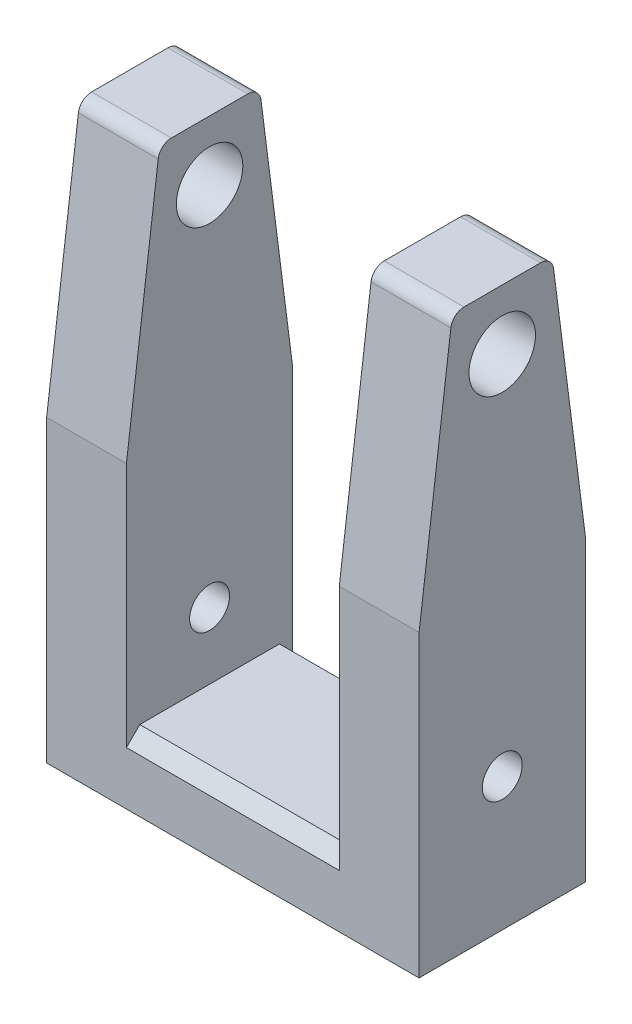
ISO-10303-21;
HEADER;
FILE_DESCRIPTION(('STEP AP214'),'2;1');
FILE_NAME('part.step','',(''),(''),'','','');
FILE_SCHEMA(('AUTOMOTIVE_DESIGN { 1 0 10303 214 1 1 1 1 }'));
ENDSEC;
DATA;
#1=APPLICATION_CONTEXT('core data for automotive mechanical design processes');
#2=APPLICATION_PROTOCOL_DEFINITION('international standard','automotive_design',2000,#1);
#3=PRODUCT_CONTEXT('',#1,'mechanical');
#4=PRODUCT('Part','Part','',(#3));
#5=PRODUCT_RELATED_PRODUCT_CATEGORY('part','',(#4));
#6=PRODUCT_DEFINITION_FORMATION('','',#4);
#7=PRODUCT_DEFINITION_CONTEXT('part definition',#1,'design');
#8=PRODUCT_DEFINITION('design','',#6,#7);
#9=PRODUCT_DEFINITION_SHAPE('','',#8);
#10=(LENGTH_UNIT() NAMED_UNIT(*) SI_UNIT(.MILLI.,.METRE.));
#11=(NAMED_UNIT(*) PLANE_ANGLE_UNIT() SI_UNIT($,.RADIAN.));
#12=(NAMED_UNIT(*) SI_UNIT($,.STERADIAN.) SOLID_ANGLE_UNIT());
#13=UNCERTAINTY_MEASURE_WITH_UNIT(LENGTH_MEASURE(1.E-05),#10,'distance_accuracy_value','');
#14=(GEOMETRIC_REPRESENTATION_CONTEXT(3) GLOBAL_UNCERTAINTY_ASSIGNED_CONTEXT((#13)) GLOBAL_UNIT_ASSIGNED_CONTEXT((#10,
#11,#12)) REPRESENTATION_CONTEXT('',''));
#15=CARTESIAN_POINT('',(0.,0.,0.));
#16=DIRECTION('',(0.,0.,1.));
#17=DIRECTION('',(1.,0.,0.));
#18=AXIS2_PLACEMENT_3D('',#15,#16,#17);
#19=CARTESIAN_POINT('',(12.,82.,-5.74004069217051));
#20=DIRECTION('',(-1.,0.,0.));
#21=DIRECTION('',(0.,0.,1.));
#22=AXIS2_PLACEMENT_3D('',#19,#20,#21);
#23=PLANE('',#22);
#24=CARTESIAN_POINT('',(12.,82.,-5.74004069217051));
#25=DIRECTION('',(1.,0.,0.));
#26=DIRECTION('',(0.,0.,1.));
#27=AXIS2_PLACEMENT_3D('',#24,#25,#26);
#28=CIRCLE('',#27,2.);
#29=CARTESIAN_POINT('',(12.,82.2543286319708,-7.72380402154221));
#30=VERTEX_POINT('',#29);
#31=CARTESIAN_POINT('',(12.,84.,-5.74004069217051));
#32=VERTEX_POINT('',#31);
#33=EDGE_CURVE('E247',#30,#32,#28,.T.);
#34=ORIENTED_EDGE('',*,*,#33,.T.);
#35=DIRECTION('',(0.,0.,1.));
#36=VECTOR('',#35,1.);
#37=CARTESIAN_POINT('',(12.,84.,5.74004069217051));
#38=LINE('',#37,#36);
#39=CARTESIAN_POINT('',(12.,84.,5.74004069217051));
#40=VERTEX_POINT('',#39);
#41=EDGE_CURVE('E250',#32,#40,#38,.T.);
#42=ORIENTED_EDGE('',*,*,#41,.T.);
#43=CARTESIAN_POINT('',(12.,82.,5.74004069217051));
#44=DIRECTION('',(1.,0.,0.));
#45=DIRECTION('',(0.,0.,1.));
#46=AXIS2_PLACEMENT_3D('',#43,#44,#45);
#47=CIRCLE('',#46,1.99999999999999);
#48=CARTESIAN_POINT('',(12.,82.2543286319707,7.72380402154221));
#49=VERTEX_POINT('',#48);
#50=EDGE_CURVE('E253',#40,#49,#47,.T.);
#51=ORIENTED_EDGE('',*,*,#50,.T.);
#52=DIRECTION('',(0.,-0.991881664685851,0.127164315985365));
#53=VECTOR('',#52,1.);
#54=CARTESIAN_POINT('',(12.,45.,12.5));
#55=LINE('',#54,#53);
#56=CARTESIAN_POINT('',(12.,45.,12.5));
#57=VERTEX_POINT('',#56);
#58=EDGE_CURVE('E255',#49,#57,#55,.T.);
#59=ORIENTED_EDGE('',*,*,#58,.T.);
#60=DIRECTION('',(0.,-1.,0.));
#61=VECTOR('',#60,1.);
#62=CARTESIAN_POINT('',(12.,45.,12.5));
#63=LINE('',#62,#61);
#64=CARTESIAN_POINT('',(12.,0.,12.5));
#65=VERTEX_POINT('',#64);
#66=EDGE_CURVE('E257',#57,#65,#63,.T.);
#67=ORIENTED_EDGE('',*,*,#66,.T.);
#68=DIRECTION('',(0.,0.,-1.));
#69=VECTOR('',#68,1.);
#70=CARTESIAN_POINT('',(12.,0.,-12.5));
#71=LINE('',#70,#69);
#72=CARTESIAN_POINT('',(12.,0.,-12.5));
#73=VERTEX_POINT('',#72);
#74=EDGE_CURVE('E259',#65,#73,#71,.T.);
#75=ORIENTED_EDGE('',*,*,#74,.T.);
#76=DIRECTION('',(0.,1.,0.));
#77=VECTOR('',#76,1.);
#78=CARTESIAN_POINT('',(12.,45.,-12.5));
#79=LINE('',#78,#77);
#80=CARTESIAN_POINT('',(12.,45.,-12.5));
#81=VERTEX_POINT('',#80);
#82=EDGE_CURVE('E261',#73,#81,#79,.T.);
#83=ORIENTED_EDGE('',*,*,#82,.T.);
#84=DIRECTION('',(0.,0.991881664685851,0.127164315985365));
#85=VECTOR('',#84,1.);
#86=CARTESIAN_POINT('',(12.,82.2543286319708,-7.72380402154221));
#87=LINE('',#86,#85);
#88=EDGE_CURVE('E263',#81,#30,#87,.T.);
#89=ORIENTED_EDGE('',*,*,#88,.T.);
#90=EDGE_LOOP('',(#34,#42,#51,#59,#67,#75,#83,#89));
#91=FACE_BOUND('',#90,.T.);
#92=CARTESIAN_POINT('',(12.,20.,0.));
#93=DIRECTION('',(1.,0.,0.));
#94=DIRECTION('',(0.,0.,-1.));
#95=AXIS2_PLACEMENT_3D('',#92,#93,#94);
#96=CIRCLE('',#95,3.);
#97=CARTESIAN_POINT('',(12.,20.,-3.));
#98=VERTEX_POINT('',#97);
#99=EDGE_CURVE('E241',#98,#98,#96,.T.);
#100=ORIENTED_EDGE('',*,*,#99,.F.);
#101=EDGE_LOOP('',(#100));
#102=FACE_BOUND('',#101,.T.);
#103=CARTESIAN_POINT('',(12.,75.,0.));
#104=DIRECTION('',(1.,0.,0.));
#105=DIRECTION('',(0.,0.,-1.));
#106=AXIS2_PLACEMENT_3D('',#103,#104,#105);
#107=CIRCLE('',#106,5.);
#108=CARTESIAN_POINT('',(12.,75.,-4.99999999999998));
#109=VERTEX_POINT('',#108);
#110=EDGE_CURVE('E235',#109,#109,#107,.T.);
#111=ORIENTED_EDGE('',*,*,#110,.F.);
#112=EDGE_LOOP('',(#111));
#113=FACE_BOUND('',#112,.T.);
#114=ADVANCED_FACE('F35',(#91,#102,#113),#23,.F.);
#115=CARTESIAN_POINT('',(0.,82.,-5.74004069217051));
#116=DIRECTION('',(-1.,0.,0.));
#117=DIRECTION('',(0.,0.,1.));
#118=AXIS2_PLACEMENT_3D('',#115,#116,#117);
#119=PLANE('',#118);
#120=DIRECTION('',(0.,0.,-1.));
#121=VECTOR('',#120,1.);
#122=CARTESIAN_POINT('',(0.,10.,12.5));
#123=LINE('',#122,#121);
#124=CARTESIAN_POINT('',(0.,10.,10.5));
#125=VERTEX_POINT('',#124);
#126=CARTESIAN_POINT('',(0.,10.,-10.5));
#127=VERTEX_POINT('',#126);
#128=EDGE_CURVE('E172',#125,#127,#123,.T.);
#129=ORIENTED_EDGE('',*,*,#128,.F.);
#130=DIRECTION('',(0.,0.70710678118655,-0.707106781186545));
#131=VECTOR('',#130,1.);
#132=CARTESIAN_POINT('',(0.,10.,10.5));
#133=LINE('',#132,#131);
#134=CARTESIAN_POINT('',(0.,8.,12.5));
#135=VERTEX_POINT('',#134);
#136=EDGE_CURVE('E309',#125,#135,#133,.F.);
#137=ORIENTED_EDGE('',*,*,#136,.T.);
#138=DIRECTION('',(0.,-1.,0.));
#139=VECTOR('',#138,1.);
#140=CARTESIAN_POINT('',(0.,45.,12.5));
#141=LINE('',#140,#139);
#142=CARTESIAN_POINT('',(0.,45.,12.5));
#143=VERTEX_POINT('',#142);
#144=EDGE_CURVE('E274',#143,#135,#141,.T.);
#145=ORIENTED_EDGE('',*,*,#144,.F.);
#146=DIRECTION('',(0.,-0.991881664685851,0.127164315985365));
#147=VECTOR('',#146,1.);
#148=CARTESIAN_POINT('',(0.,45.,12.5));
#149=LINE('',#148,#147);
#150=CARTESIAN_POINT('',(0.,82.2543286319707,7.72380402154221));
#151=VERTEX_POINT('',#150);
#152=EDGE_CURVE('E272',#151,#143,#149,.T.);
#153=ORIENTED_EDGE('',*,*,#152,.F.);
#154=CARTESIAN_POINT('',(0.,82.,5.74004069217051));
#155=DIRECTION('',(1.,0.,0.));
#156=DIRECTION('',(0.,0.,1.));
#157=AXIS2_PLACEMENT_3D('',#154,#155,#156);
#158=CIRCLE('',#157,1.99999999999999);
#159=CARTESIAN_POINT('',(0.,84.,5.74004069217051));
#160=VERTEX_POINT('',#159);
#161=EDGE_CURVE('E270',#160,#151,#158,.T.);
#162=ORIENTED_EDGE('',*,*,#161,.F.);
#163=DIRECTION('',(0.,0.,1.));
#164=VECTOR('',#163,1.);
#165=CARTESIAN_POINT('',(0.,84.,5.74004069217051));
#166=LINE('',#165,#164);
#167=CARTESIAN_POINT('',(0.,84.,-5.74004069217051));
#168=VERTEX_POINT('',#167);
#169=EDGE_CURVE('E268',#168,#160,#166,.T.);
#170=ORIENTED_EDGE('',*,*,#169,.F.);
#171=CARTESIAN_POINT('',(0.,82.,-5.74004069217051));
#172=DIRECTION('',(1.,0.,0.));
#173=DIRECTION('',(0.,0.,1.));
#174=AXIS2_PLACEMENT_3D('',#171,#172,#173);
#175=CIRCLE('',#174,2.);
#176=CARTESIAN_POINT('',(0.,82.2543286319708,-7.72380402154221));
#177=VERTEX_POINT('',#176);
#178=EDGE_CURVE('E244',#177,#168,#175,.T.);
#179=ORIENTED_EDGE('',*,*,#178,.F.);
#180=DIRECTION('',(0.,0.991881664685851,0.127164315985365));
#181=VECTOR('',#180,1.);
#182=CARTESIAN_POINT('',(0.,82.2543286319708,-7.72380402154221));
#183=LINE('',#182,#181);
#184=CARTESIAN_POINT('',(0.,45.,-12.5));
#185=VERTEX_POINT('',#184);
#186=EDGE_CURVE('E251',#185,#177,#183,.T.);
#187=ORIENTED_EDGE('',*,*,#186,.F.);
#188=DIRECTION('',(0.,1.,0.));
#189=VECTOR('',#188,1.);
#190=CARTESIAN_POINT('',(0.,45.,-12.5));
#191=LINE('',#190,#189);
#192=CARTESIAN_POINT('',(0.,7.99999999999999,-12.5));
#193=VERTEX_POINT('',#192);
#194=EDGE_CURVE('E51',#193,#185,#191,.T.);
#195=ORIENTED_EDGE('',*,*,#194,.F.);
#196=DIRECTION('',(0.,-0.707106781186546,-0.707106781186549));
#197=VECTOR('',#196,1.);
#198=CARTESIAN_POINT('',(0.,7.99999999999999,-12.5));
#199=LINE('',#198,#197);
#200=EDGE_CURVE('E44',#193,#127,#199,.F.);
#201=ORIENTED_EDGE('',*,*,#200,.T.);
#202=EDGE_LOOP('',(#129,#137,#145,#153,#162,#170,#179,#187,#195,#201));
#203=FACE_BOUND('',#202,.T.);
#204=CARTESIAN_POINT('',(0.,20.,0.));
#205=DIRECTION('',(1.,0.,0.));
#206=DIRECTION('',(0.,0.,-1.));
#207=AXIS2_PLACEMENT_3D('',#204,#205,#206);
#208=CIRCLE('',#207,3.);
#209=CARTESIAN_POINT('',(0.,20.,-3.));
#210=VERTEX_POINT('',#209);
#211=EDGE_CURVE('E238',#210,#210,#208,.T.);
#212=ORIENTED_EDGE('',*,*,#211,.T.);
#213=EDGE_LOOP('',(#212));
#214=FACE_BOUND('',#213,.T.);
#215=CARTESIAN_POINT('',(0.,75.,0.));
#216=DIRECTION('',(1.,0.,0.));
#217=DIRECTION('',(0.,0.,-1.));
#218=AXIS2_PLACEMENT_3D('',#215,#216,#217);
#219=CIRCLE('',#218,5.);
#220=CARTESIAN_POINT('',(0.,75.,-4.99999999999998));
#221=VERTEX_POINT('',#220);
#222=EDGE_CURVE('E234',#221,#221,#219,.T.);
#223=ORIENTED_EDGE('',*,*,#222,.T.);
#224=EDGE_LOOP('',(#223));
#225=FACE_BOUND('',#224,.T.);
#226=ADVANCED_FACE('F314',(#203,#214,#225),#119,.T.);
#227=CARTESIAN_POINT('',(12.,82.,-5.74004069217051));
#228=DIRECTION('',(-1.,0.,0.));
#229=DIRECTION('',(0.,0.,1.));
#230=AXIS2_PLACEMENT_3D('',#227,#228,#229);
#231=CYLINDRICAL_SURFACE('',#230,2.);
#232=ORIENTED_EDGE('',*,*,#178,.T.);
#233=DIRECTION('',(-1.,0.,0.));
#234=VECTOR('',#233,1.);
#235=CARTESIAN_POINT('',(12.,84.,-5.74004069217051));
#236=LINE('',#235,#234);
#237=EDGE_CURVE('E296',#32,#168,#236,.T.);
#238=ORIENTED_EDGE('',*,*,#237,.F.);
#239=ORIENTED_EDGE('',*,*,#33,.F.);
#240=DIRECTION('',(-1.,0.,0.));
#241=VECTOR('',#240,1.);
#242=CARTESIAN_POINT('',(12.,82.2543286319708,-7.72380402154221));
#243=LINE('',#242,#241);
#244=EDGE_CURVE('E265',#30,#177,#243,.T.);
#245=ORIENTED_EDGE('',*,*,#244,.T.);
#246=EDGE_LOOP('',(#232,#238,#239,#245));
#247=FACE_BOUND('',#246,.T.);
#248=ADVANCED_FACE('F368',(#247),#231,.T.);
#249=CARTESIAN_POINT('',(12.,84.,5.74004069217051));
#250=DIRECTION('',(0.,-1.,0.));
#251=DIRECTION('',(0.,0.,-1.));
#252=AXIS2_PLACEMENT_3D('',#249,#250,#251);
#253=PLANE('',#252);
#254=ORIENTED_EDGE('',*,*,#169,.T.);
#255=DIRECTION('',(-1.,0.,0.));
#256=VECTOR('',#255,1.);
#257=CARTESIAN_POINT('',(12.,84.,5.74004069217051));
#258=LINE('',#257,#256);
#259=EDGE_CURVE('E293',#40,#160,#258,.T.);
#260=ORIENTED_EDGE('',*,*,#259,.F.);
#261=ORIENTED_EDGE('',*,*,#41,.F.);
#262=ORIENTED_EDGE('',*,*,#237,.T.);
#263=EDGE_LOOP('',(#254,#260,#261,#262));
#264=FACE_BOUND('',#263,.T.);
#265=ADVANCED_FACE('F397',(#264),#253,.F.);
#266=CARTESIAN_POINT('',(12.,82.,5.74004069217051));
#267=DIRECTION('',(-1.,0.,0.));
#268=DIRECTION('',(0.,0.,1.));
#269=AXIS2_PLACEMENT_3D('',#266,#267,#268);
#270=CYLINDRICAL_SURFACE('',#269,1.99999999999999);
#271=ORIENTED_EDGE('',*,*,#161,.T.);
#272=DIRECTION('',(-1.,0.,0.));
#273=VECTOR('',#272,1.);
#274=CARTESIAN_POINT('',(12.,82.2543286319707,7.72380402154221));
#275=LINE('',#274,#273);
#276=EDGE_CURVE('E290',#49,#151,#275,.T.);
#277=ORIENTED_EDGE('',*,*,#276,.F.);
#278=ORIENTED_EDGE('',*,*,#50,.F.);
#279=ORIENTED_EDGE('',*,*,#259,.T.);
#280=EDGE_LOOP('',(#271,#277,#278,#279));
#281=FACE_BOUND('',#280,.T.);
#282=ADVANCED_FACE('F393',(#281),#270,.T.);
#283=CARTESIAN_POINT('',(12.,45.,12.5));
#284=DIRECTION('',(0.,-0.127164315985365,-0.99188166468585));
#285=DIRECTION('',(0.,0.991881664685851,-0.127164315985365));
#286=AXIS2_PLACEMENT_3D('',#283,#284,#285);
#287=PLANE('',#286);
#288=ORIENTED_EDGE('',*,*,#152,.T.);
#289=DIRECTION('',(-1.,0.,0.));
#290=VECTOR('',#289,1.);
#291=CARTESIAN_POINT('',(12.,45.,12.5));
#292=LINE('',#291,#290);
#293=EDGE_CURVE('E287',#57,#143,#292,.T.);
#294=ORIENTED_EDGE('',*,*,#293,.F.);
#295=ORIENTED_EDGE('',*,*,#58,.F.);
#296=ORIENTED_EDGE('',*,*,#276,.T.);
#297=EDGE_LOOP('',(#288,#294,#295,#296));
#298=FACE_BOUND('',#297,.T.);
#299=ADVANCED_FACE('F389',(#298),#287,.F.);
#300=CARTESIAN_POINT('',(12.,45.,12.5));
#301=DIRECTION('',(0.,0.,-1.));
#302=DIRECTION('',(-1.,0.,0.));
#303=AXIS2_PLACEMENT_3D('',#300,#301,#302);
#304=PLANE('',#303);
#305=ORIENTED_EDGE('',*,*,#144,.T.);
#306=DIRECTION('',(-1.,0.,0.));
#307=VECTOR('',#306,1.);
#308=CARTESIAN_POINT('',(12.,8.,12.5));
#309=LINE('',#308,#307);
#310=CARTESIAN_POINT('',(-32.,8.00000000000001,12.5));
#311=VERTEX_POINT('',#310);
#312=EDGE_CURVE('E304',#135,#311,#309,.T.);
#313=ORIENTED_EDGE('',*,*,#312,.T.);
#314=DIRECTION('',(0.,-1.,0.));
#315=VECTOR('',#314,1.);
#316=CARTESIAN_POINT('',(-32.,45.,12.5));
#317=LINE('',#316,#315);
#318=CARTESIAN_POINT('',(-32.,45.,12.5));
#319=VERTEX_POINT('',#318);
#320=EDGE_CURVE('E221',#319,#311,#317,.T.);
#321=ORIENTED_EDGE('',*,*,#320,.F.);
#322=DIRECTION('',(1.,0.,0.));
#323=VECTOR('',#322,1.);
#324=CARTESIAN_POINT('',(-44.,45.,12.5));
#325=LINE('',#324,#323);
#326=CARTESIAN_POINT('',(-44.,45.,12.5));
#327=VERTEX_POINT('',#326);
#328=EDGE_CURVE('E227',#327,#319,#325,.T.);
#329=ORIENTED_EDGE('',*,*,#328,.F.);
#330=DIRECTION('',(0.,-1.,0.));
#331=VECTOR('',#330,1.);
#332=CARTESIAN_POINT('',(-44.,45.,12.5));
#333=LINE('',#332,#331);
#334=CARTESIAN_POINT('',(-44.,0.,12.5));
#335=VERTEX_POINT('',#334);
#336=EDGE_CURVE('E200',#327,#335,#333,.T.);
#337=ORIENTED_EDGE('',*,*,#336,.T.);
#338=DIRECTION('',(-1.,0.,0.));
#339=VECTOR('',#338,1.);
#340=CARTESIAN_POINT('',(12.,0.,12.5));
#341=LINE('',#340,#339);
#342=EDGE_CURVE('E285',#65,#335,#341,.T.);
#343=ORIENTED_EDGE('',*,*,#342,.F.);
#344=ORIENTED_EDGE('',*,*,#66,.F.);
#345=ORIENTED_EDGE('',*,*,#293,.T.);
#346=EDGE_LOOP('',(#305,#313,#321,#329,#337,#343,#344,#345));
#347=FACE_BOUND('',#346,.T.);
#348=ADVANCED_FACE('F385',(#347),#304,.F.);
#349=CARTESIAN_POINT('',(12.,0.,-12.5));
#350=DIRECTION('',(0.,1.,0.));
#351=DIRECTION('',(0.,0.,1.));
#352=AXIS2_PLACEMENT_3D('',#349,#350,#351);
#353=PLANE('',#352);
#354=ORIENTED_EDGE('',*,*,#342,.T.);
#355=DIRECTION('',(0.,0.,-1.));
#356=VECTOR('',#355,1.);
#357=CARTESIAN_POINT('',(-44.,0.,-12.5));
#358=LINE('',#357,#356);
#359=CARTESIAN_POINT('',(-44.,0.,-12.5));
#360=VERTEX_POINT('',#359);
#361=EDGE_CURVE('E203',#335,#360,#358,.T.);
#362=ORIENTED_EDGE('',*,*,#361,.T.);
#363=DIRECTION('',(-1.,0.,0.));
#364=VECTOR('',#363,1.);
#365=CARTESIAN_POINT('',(12.,0.,-12.5));
#366=LINE('',#365,#364);
#367=EDGE_CURVE('E283',#73,#360,#366,.T.);
#368=ORIENTED_EDGE('',*,*,#367,.F.);
#369=ORIENTED_EDGE('',*,*,#74,.F.);
#370=EDGE_LOOP('',(#354,#362,#368,#369));
#371=FACE_BOUND('',#370,.T.);
#372=ADVANCED_FACE('F382',(#371),#353,.F.);
#373=CARTESIAN_POINT('',(12.,45.,-12.5));
#374=DIRECTION('',(0.,0.,1.));
#375=DIRECTION('',(1.,0.,0.));
#376=AXIS2_PLACEMENT_3D('',#373,#374,#375);
#377=PLANE('',#376);
#378=DIRECTION('',(1.,0.,0.));
#379=VECTOR('',#378,1.);
#380=CARTESIAN_POINT('',(12.,7.99999999999999,-12.5));
#381=LINE('',#380,#379);
#382=CARTESIAN_POINT('',(-32.,8.00000000000001,-12.5));
#383=VERTEX_POINT('',#382);
#384=EDGE_CURVE('E307',#383,#193,#381,.T.);
#385=ORIENTED_EDGE('',*,*,#384,.T.);
#386=ORIENTED_EDGE('',*,*,#194,.T.);
#387=DIRECTION('',(-1.,0.,0.));
#388=VECTOR('',#387,1.);
#389=CARTESIAN_POINT('',(12.,45.,-12.5));
#390=LINE('',#389,#388);
#391=EDGE_CURVE('E280',#81,#185,#390,.T.);
#392=ORIENTED_EDGE('',*,*,#391,.F.);
#393=ORIENTED_EDGE('',*,*,#82,.F.);
#394=ORIENTED_EDGE('',*,*,#367,.T.);
#395=DIRECTION('',(0.,1.,0.));
#396=VECTOR('',#395,1.);
#397=CARTESIAN_POINT('',(-44.,45.,-12.5));
#398=LINE('',#397,#396);
#399=CARTESIAN_POINT('',(-44.,45.,-12.5));
#400=VERTEX_POINT('',#399);
#401=EDGE_CURVE('E206',#360,#400,#398,.T.);
#402=ORIENTED_EDGE('',*,*,#401,.T.);
#403=DIRECTION('',(1.,0.,0.));
#404=VECTOR('',#403,1.);
#405=CARTESIAN_POINT('',(-44.,45.,-12.5));
#406=LINE('',#405,#404);
#407=CARTESIAN_POINT('',(-32.,45.,-12.5));
#408=VERTEX_POINT('',#407);
#409=EDGE_CURVE('E225',#400,#408,#406,.T.);
#410=ORIENTED_EDGE('',*,*,#409,.T.);
#411=DIRECTION('',(0.,1.,0.));
#412=VECTOR('',#411,1.);
#413=CARTESIAN_POINT('',(-32.,45.,-12.5));
#414=LINE('',#413,#412);
#415=EDGE_CURVE('E59',#383,#408,#414,.T.);
#416=ORIENTED_EDGE('',*,*,#415,.F.);
#417=EDGE_LOOP('',(#385,#386,#392,#393,#394,#402,#410,#416));
#418=FACE_BOUND('',#417,.T.);
#419=ADVANCED_FACE('F378',(#418),#377,.F.);
#420=CARTESIAN_POINT('',(12.,82.2543286319708,-7.72380402154221));
#421=DIRECTION('',(0.,-0.127164315985365,0.99188166468585));
#422=DIRECTION('',(0.,-0.991881664685851,-0.127164315985365));
#423=AXIS2_PLACEMENT_3D('',#420,#421,#422);
#424=PLANE('',#423);
#425=ORIENTED_EDGE('',*,*,#186,.T.);
#426=ORIENTED_EDGE('',*,*,#244,.F.);
#427=ORIENTED_EDGE('',*,*,#88,.F.);
#428=ORIENTED_EDGE('',*,*,#391,.T.);
#429=EDGE_LOOP('',(#425,#426,#427,#428));
#430=FACE_BOUND('',#429,.T.);
#431=ADVANCED_FACE('F375',(#430),#424,.F.);
#432=CARTESIAN_POINT('',(12.,20.,0.));
#433=DIRECTION('',(-1.,0.,0.));
#434=DIRECTION('',(0.,0.,1.));
#435=AXIS2_PLACEMENT_3D('',#432,#433,#434);
#436=CYLINDRICAL_SURFACE('',#435,3.);
#437=ORIENTED_EDGE('',*,*,#99,.T.);
#438=EDGE_LOOP('',(#437));
#439=FACE_BOUND('',#438,.T.);
#440=ORIENTED_EDGE('',*,*,#211,.F.);
#441=EDGE_LOOP('',(#440));
#442=FACE_BOUND('',#441,.T.);
#443=ADVANCED_FACE('F372',(#439,#442),#436,.F.);
#444=CARTESIAN_POINT('',(12.,75.,0.));
#445=DIRECTION('',(-1.,0.,0.));
#446=DIRECTION('',(0.,0.,1.));
#447=AXIS2_PLACEMENT_3D('',#444,#445,#446);
#448=CYLINDRICAL_SURFACE('',#447,5.);
#449=ORIENTED_EDGE('',*,*,#110,.T.);
#450=EDGE_LOOP('',(#449));
#451=FACE_BOUND('',#450,.T.);
#452=ORIENTED_EDGE('',*,*,#222,.F.);
#453=EDGE_LOOP('',(#452));
#454=FACE_BOUND('',#453,.T.);
#455=ADVANCED_FACE('F457',(#451,#454),#448,.F.);
#456=CARTESIAN_POINT('',(-16.,10.,12.5));
#457=DIRECTION('',(0.,-1.,0.));
#458=DIRECTION('',(0.,0.,-1.));
#459=AXIS2_PLACEMENT_3D('',#456,#457,#458);
#460=PLANE('',#459);
#461=DIRECTION('',(0.,0.,-1.));
#462=VECTOR('',#461,1.);
#463=CARTESIAN_POINT('',(-32.,10.,12.5));
#464=LINE('',#463,#462);
#465=CARTESIAN_POINT('',(-32.,10.,10.5));
#466=VERTEX_POINT('',#465);
#467=CARTESIAN_POINT('',(-32.,10.,-10.5));
#468=VERTEX_POINT('',#467);
#469=EDGE_CURVE('E328',#466,#468,#464,.T.);
#470=ORIENTED_EDGE('',*,*,#469,.F.);
#471=DIRECTION('',(1.,0.,0.));
#472=VECTOR('',#471,1.);
#473=CARTESIAN_POINT('',(-16.,10.,10.5));
#474=LINE('',#473,#472);
#475=EDGE_CURVE('E301',#466,#125,#474,.T.);
#476=ORIENTED_EDGE('',*,*,#475,.T.);
#477=ORIENTED_EDGE('',*,*,#128,.T.);
#478=DIRECTION('',(-1.,0.,0.));
#479=VECTOR('',#478,1.);
#480=CARTESIAN_POINT('',(-16.,10.,-10.5));
#481=LINE('',#480,#479);
#482=EDGE_CURVE('E299',#127,#468,#481,.T.);
#483=ORIENTED_EDGE('',*,*,#482,.T.);
#484=EDGE_LOOP('',(#470,#476,#477,#483));
#485=FACE_BOUND('',#484,.T.);
#486=ADVANCED_FACE('F321',(#485),#460,.F.);
#487=CARTESIAN_POINT('',(-44.,82.,-5.74004069217051));
#488=DIRECTION('',(1.,0.,0.));
#489=DIRECTION('',(0.,0.,1.));
#490=AXIS2_PLACEMENT_3D('',#487,#488,#489);
#491=PLANE('',#490);
#492=CARTESIAN_POINT('',(-44.,82.,-5.74004069217051));
#493=DIRECTION('',(1.,0.,0.));
#494=DIRECTION('',(0.,0.,1.));
#495=AXIS2_PLACEMENT_3D('',#492,#493,#494);
#496=CIRCLE('',#495,2.);
#497=CARTESIAN_POINT('',(-44.,82.2543286319708,-7.72380402154221));
#498=VERTEX_POINT('',#497);
#499=CARTESIAN_POINT('',(-44.,84.,-5.74004069217051));
#500=VERTEX_POINT('',#499);
#501=EDGE_CURVE('E180',#498,#500,#496,.T.);
#502=ORIENTED_EDGE('',*,*,#501,.F.);
#503=DIRECTION('',(0.,0.991881664685851,0.127164315985365));
#504=VECTOR('',#503,1.);
#505=CARTESIAN_POINT('',(-44.,82.2543286319708,-7.72380402154221));
#506=LINE('',#505,#504);
#507=EDGE_CURVE('E209',#400,#498,#506,.T.);
#508=ORIENTED_EDGE('',*,*,#507,.F.);
#509=ORIENTED_EDGE('',*,*,#401,.F.);
#510=ORIENTED_EDGE('',*,*,#361,.F.);
#511=ORIENTED_EDGE('',*,*,#336,.F.);
#512=DIRECTION('',(0.,-0.991881664685851,0.127164315985365));
#513=VECTOR('',#512,1.);
#514=CARTESIAN_POINT('',(-44.,45.,12.5));
#515=LINE('',#514,#513);
#516=CARTESIAN_POINT('',(-44.,82.2543286319707,7.72380402154221));
#517=VERTEX_POINT('',#516);
#518=EDGE_CURVE('E197',#517,#327,#515,.T.);
#519=ORIENTED_EDGE('',*,*,#518,.F.);
#520=CARTESIAN_POINT('',(-44.,82.,5.74004069217051));
#521=DIRECTION('',(1.,0.,0.));
#522=DIRECTION('',(0.,0.,1.));
#523=AXIS2_PLACEMENT_3D('',#520,#521,#522);
#524=CIRCLE('',#523,1.99999999999999);
#525=CARTESIAN_POINT('',(-44.,84.,5.74004069217051));
#526=VERTEX_POINT('',#525);
#527=EDGE_CURVE('E183',#526,#517,#524,.T.);
#528=ORIENTED_EDGE('',*,*,#527,.F.);
#529=DIRECTION('',(0.,0.,1.));
#530=VECTOR('',#529,1.);
#531=CARTESIAN_POINT('',(-44.,84.,5.74004069217051));
#532=LINE('',#531,#530);
#533=EDGE_CURVE('E164',#500,#526,#532,.T.);
#534=ORIENTED_EDGE('',*,*,#533,.F.);
#535=EDGE_LOOP('',(#502,#508,#509,#510,#511,#519,#528,#534));
#536=FACE_BOUND('',#535,.T.);
#537=CARTESIAN_POINT('',(-44.,20.,0.));
#538=DIRECTION('',(1.,0.,0.));
#539=DIRECTION('',(0.,0.,-1.));
#540=AXIS2_PLACEMENT_3D('',#537,#538,#539);
#541=CIRCLE('',#540,3.);
#542=CARTESIAN_POINT('',(-44.,20.,-3.));
#543=VERTEX_POINT('',#542);
#544=EDGE_CURVE('E213',#543,#543,#541,.T.);
#545=ORIENTED_EDGE('',*,*,#544,.T.);
#546=EDGE_LOOP('',(#545));
#547=FACE_BOUND('',#546,.T.);
#548=CARTESIAN_POINT('',(-44.,75.,0.));
#549=DIRECTION('',(1.,0.,0.));
#550=DIRECTION('',(0.,0.,-1.));
#551=AXIS2_PLACEMENT_3D('',#548,#549,#550);
#552=CIRCLE('',#551,5.);
#553=CARTESIAN_POINT('',(-44.,75.,-4.99999999999998));
#554=VERTEX_POINT('',#553);
#555=EDGE_CURVE('E333',#554,#554,#552,.T.);
#556=ORIENTED_EDGE('',*,*,#555,.T.);
#557=EDGE_LOOP('',(#556));
#558=FACE_BOUND('',#557,.T.);
#559=ADVANCED_FACE('F177',(#536,#547,#558),#491,.F.);
#560=CARTESIAN_POINT('',(-32.,82.,-5.74004069217051));
#561=DIRECTION('',(1.,0.,0.));
#562=DIRECTION('',(0.,0.,1.));
#563=AXIS2_PLACEMENT_3D('',#560,#561,#562);
#564=PLANE('',#563);
#565=ORIENTED_EDGE('',*,*,#320,.T.);
#566=DIRECTION('',(0.,-0.70710678118655,0.707106781186545));
#567=VECTOR('',#566,1.);
#568=CARTESIAN_POINT('',(-32.,10.,10.5));
#569=LINE('',#568,#567);
#570=EDGE_CURVE('E312',#311,#466,#569,.F.);
#571=ORIENTED_EDGE('',*,*,#570,.T.);
#572=ORIENTED_EDGE('',*,*,#469,.T.);
#573=DIRECTION('',(0.,0.707106781186546,0.707106781186549));
#574=VECTOR('',#573,1.);
#575=CARTESIAN_POINT('',(-32.,7.99999999999999,-12.5));
#576=LINE('',#575,#574);
#577=EDGE_CURVE('E11',#468,#383,#576,.F.);
#578=ORIENTED_EDGE('',*,*,#577,.T.);
#579=ORIENTED_EDGE('',*,*,#415,.T.);
#580=DIRECTION('',(0.,0.991881664685851,0.127164315985365));
#581=VECTOR('',#580,1.);
#582=CARTESIAN_POINT('',(-32.,82.2543286319708,-7.72380402154221));
#583=LINE('',#582,#581);
#584=CARTESIAN_POINT('',(-32.,82.2543286319708,-7.72380402154221));
#585=VERTEX_POINT('',#584);
#586=EDGE_CURVE('E188',#408,#585,#583,.T.);
#587=ORIENTED_EDGE('',*,*,#586,.T.);
#588=CARTESIAN_POINT('',(-32.,82.,-5.74004069217051));
#589=DIRECTION('',(1.,0.,0.));
#590=DIRECTION('',(0.,0.,1.));
#591=AXIS2_PLACEMENT_3D('',#588,#589,#590);
#592=CIRCLE('',#591,2.);
#593=CARTESIAN_POINT('',(-32.,84.,-5.74004069217051));
#594=VERTEX_POINT('',#593);
#595=EDGE_CURVE('E211',#585,#594,#592,.T.);
#596=ORIENTED_EDGE('',*,*,#595,.T.);
#597=DIRECTION('',(0.,0.,1.));
#598=VECTOR('',#597,1.);
#599=CARTESIAN_POINT('',(-32.,84.,5.74004069217051));
#600=LINE('',#599,#598);
#601=CARTESIAN_POINT('',(-32.,84.,5.74004069217051));
#602=VERTEX_POINT('',#601);
#603=EDGE_CURVE('E167',#594,#602,#600,.T.);
#604=ORIENTED_EDGE('',*,*,#603,.T.);
#605=CARTESIAN_POINT('',(-32.,82.,5.74004069217051));
#606=DIRECTION('',(1.,0.,0.));
#607=DIRECTION('',(0.,0.,1.));
#608=AXIS2_PLACEMENT_3D('',#605,#606,#607);
#609=CIRCLE('',#608,1.99999999999999);
#610=CARTESIAN_POINT('',(-32.,82.2543286319707,7.72380402154221));
#611=VERTEX_POINT('',#610);
#612=EDGE_CURVE('E215',#602,#611,#609,.T.);
#613=ORIENTED_EDGE('',*,*,#612,.T.);
#614=DIRECTION('',(0.,-0.991881664685851,0.127164315985365));
#615=VECTOR('',#614,1.);
#616=CARTESIAN_POINT('',(-32.,45.,12.5));
#617=LINE('',#616,#615);
#618=EDGE_CURVE('E218',#611,#319,#617,.T.);
#619=ORIENTED_EDGE('',*,*,#618,.T.);
#620=EDGE_LOOP('',(#565,#571,#572,#578,#579,#587,#596,#604,#613,#619));
#621=FACE_BOUND('',#620,.T.);
#622=CARTESIAN_POINT('',(-32.,20.,0.));
#623=DIRECTION('',(1.,0.,0.));
#624=DIRECTION('',(0.,0.,-1.));
#625=AXIS2_PLACEMENT_3D('',#622,#623,#624);
#626=CIRCLE('',#625,3.);
#627=CARTESIAN_POINT('',(-32.,20.,-3.));
#628=VERTEX_POINT('',#627);
#629=EDGE_CURVE('E193',#628,#628,#626,.T.);
#630=ORIENTED_EDGE('',*,*,#629,.F.);
#631=EDGE_LOOP('',(#630));
#632=FACE_BOUND('',#631,.T.);
#633=CARTESIAN_POINT('',(-32.,75.,0.));
#634=DIRECTION('',(1.,0.,0.));
#635=DIRECTION('',(0.,0.,-1.));
#636=AXIS2_PLACEMENT_3D('',#633,#634,#635);
#637=CIRCLE('',#636,5.);
#638=CARTESIAN_POINT('',(-32.,75.,-4.99999999999998));
#639=VERTEX_POINT('',#638);
#640=EDGE_CURVE('E330',#639,#639,#637,.T.);
#641=ORIENTED_EDGE('',*,*,#640,.F.);
#642=EDGE_LOOP('',(#641));
#643=FACE_BOUND('',#642,.T.);
#644=ADVANCED_FACE('F326',(#621,#632,#643),#564,.T.);
#645=CARTESIAN_POINT('',(-44.,82.,-5.74004069217051));
#646=DIRECTION('',(1.,0.,0.));
#647=DIRECTION('',(0.,0.,1.));
#648=AXIS2_PLACEMENT_3D('',#645,#646,#647);
#649=CYLINDRICAL_SURFACE('',#648,2.);
#650=ORIENTED_EDGE('',*,*,#595,.F.);
#651=DIRECTION('',(1.,0.,0.));
#652=VECTOR('',#651,1.);
#653=CARTESIAN_POINT('',(-44.,82.2543286319708,-7.72380402154221));
#654=LINE('',#653,#652);
#655=EDGE_CURVE('E186',#498,#585,#654,.T.);
#656=ORIENTED_EDGE('',*,*,#655,.F.);
#657=ORIENTED_EDGE('',*,*,#501,.T.);
#658=DIRECTION('',(1.,0.,0.));
#659=VECTOR('',#658,1.);
#660=CARTESIAN_POINT('',(-44.,84.,-5.74004069217051));
#661=LINE('',#660,#659);
#662=EDGE_CURVE('E161',#500,#594,#661,.T.);
#663=ORIENTED_EDGE('',*,*,#662,.T.);
#664=EDGE_LOOP('',(#650,#656,#657,#663));
#665=FACE_BOUND('',#664,.T.);
#666=ADVANCED_FACE('F185',(#665),#649,.T.);
#667=CARTESIAN_POINT('',(-44.,84.,5.74004069217051));
#668=DIRECTION('',(0.,-1.,0.));
#669=DIRECTION('',(0.,0.,-1.));
#670=AXIS2_PLACEMENT_3D('',#667,#668,#669);
#671=PLANE('',#670);
#672=ORIENTED_EDGE('',*,*,#603,.F.);
#673=ORIENTED_EDGE('',*,*,#662,.F.);
#674=ORIENTED_EDGE('',*,*,#533,.T.);
#675=DIRECTION('',(1.,0.,0.));
#676=VECTOR('',#675,1.);
#677=CARTESIAN_POINT('',(-44.,84.,5.74004069217051));
#678=LINE('',#677,#676);
#679=EDGE_CURVE('E173',#526,#602,#678,.T.);
#680=ORIENTED_EDGE('',*,*,#679,.T.);
#681=EDGE_LOOP('',(#672,#673,#674,#680));
#682=FACE_BOUND('',#681,.T.);
#683=ADVANCED_FACE('F163',(#682),#671,.F.);
#684=CARTESIAN_POINT('',(-44.,82.,5.74004069217051));
#685=DIRECTION('',(1.,0.,0.));
#686=DIRECTION('',(0.,0.,1.));
#687=AXIS2_PLACEMENT_3D('',#684,#685,#686);
#688=CYLINDRICAL_SURFACE('',#687,1.99999999999999);
#689=ORIENTED_EDGE('',*,*,#612,.F.);
#690=ORIENTED_EDGE('',*,*,#679,.F.);
#691=ORIENTED_EDGE('',*,*,#527,.T.);
#692=DIRECTION('',(1.,0.,0.));
#693=VECTOR('',#692,1.);
#694=CARTESIAN_POINT('',(-44.,82.2543286319707,7.72380402154221));
#695=LINE('',#694,#693);
#696=EDGE_CURVE('E229',#517,#611,#695,.T.);
#697=ORIENTED_EDGE('',*,*,#696,.T.);
#698=EDGE_LOOP('',(#689,#690,#691,#697));
#699=FACE_BOUND('',#698,.T.);
#700=ADVANCED_FACE('F433',(#699),#688,.T.);
#701=CARTESIAN_POINT('',(-44.,45.,12.5));
#702=DIRECTION('',(0.,-0.127164315985365,-0.99188166468585));
#703=DIRECTION('',(0.,0.991881664685851,-0.127164315985365));
#704=AXIS2_PLACEMENT_3D('',#701,#702,#703);
#705=PLANE('',#704);
#706=ORIENTED_EDGE('',*,*,#618,.F.);
#707=ORIENTED_EDGE('',*,*,#696,.F.);
#708=ORIENTED_EDGE('',*,*,#518,.T.);
#709=ORIENTED_EDGE('',*,*,#328,.T.);
#710=EDGE_LOOP('',(#706,#707,#708,#709));
#711=FACE_BOUND('',#710,.T.);
#712=ADVANCED_FACE('F435',(#711),#705,.F.);
#713=CARTESIAN_POINT('',(-44.,82.2543286319708,-7.72380402154221));
#714=DIRECTION('',(0.,-0.127164315985365,0.99188166468585));
#715=DIRECTION('',(0.,-0.991881664685851,-0.127164315985365));
#716=AXIS2_PLACEMENT_3D('',#713,#714,#715);
#717=PLANE('',#716);
#718=ORIENTED_EDGE('',*,*,#586,.F.);
#719=ORIENTED_EDGE('',*,*,#409,.F.);
#720=ORIENTED_EDGE('',*,*,#507,.T.);
#721=ORIENTED_EDGE('',*,*,#655,.T.);
#722=EDGE_LOOP('',(#718,#719,#720,#721));
#723=FACE_BOUND('',#722,.T.);
#724=ADVANCED_FACE('F358',(#723),#717,.F.);
#725=CARTESIAN_POINT('',(-44.,20.,0.));
#726=DIRECTION('',(1.,0.,0.));
#727=DIRECTION('',(0.,0.,1.));
#728=AXIS2_PLACEMENT_3D('',#725,#726,#727);
#729=CYLINDRICAL_SURFACE('',#728,3.);
#730=ORIENTED_EDGE('',*,*,#544,.F.);
#731=EDGE_LOOP('',(#730));
#732=FACE_BOUND('',#731,.T.);
#733=ORIENTED_EDGE('',*,*,#629,.T.);
#734=EDGE_LOOP('',(#733));
#735=FACE_BOUND('',#734,.T.);
#736=ADVANCED_FACE('F342',(#732,#735),#729,.F.);
#737=CARTESIAN_POINT('',(-44.,75.,0.));
#738=DIRECTION('',(1.,0.,0.));
#739=DIRECTION('',(0.,0.,1.));
#740=AXIS2_PLACEMENT_3D('',#737,#738,#739);
#741=CYLINDRICAL_SURFACE('',#740,5.);
#742=ORIENTED_EDGE('',*,*,#555,.F.);
#743=EDGE_LOOP('',(#742));
#744=FACE_BOUND('',#743,.T.);
#745=ORIENTED_EDGE('',*,*,#640,.T.);
#746=EDGE_LOOP('',(#745));
#747=FACE_BOUND('',#746,.T.);
#748=ADVANCED_FACE('F348',(#744,#747),#741,.F.);
#749=CARTESIAN_POINT('',(-16.,10.,10.5));
#750=DIRECTION('',(0.,-0.707106781186545,-0.70710678118655));
#751=DIRECTION('',(1.,0.,0.));
#752=AXIS2_PLACEMENT_3D('',#749,#750,#751);
#753=PLANE('',#752);
#754=ORIENTED_EDGE('',*,*,#570,.F.);
#755=ORIENTED_EDGE('',*,*,#312,.F.);
#756=ORIENTED_EDGE('',*,*,#136,.F.);
#757=ORIENTED_EDGE('',*,*,#475,.F.);
#758=EDGE_LOOP('',(#754,#755,#756,#757));
#759=FACE_BOUND('',#758,.T.);
#760=ADVANCED_FACE('F350',(#759),#753,.F.);
#761=CARTESIAN_POINT('',(12.,7.99999999999999,-12.5));
#762=DIRECTION('',(0.,-0.707106781186549,0.707106781186546));
#763=DIRECTION('',(1.,0.,0.));
#764=AXIS2_PLACEMENT_3D('',#761,#762,#763);
#765=PLANE('',#764);
#766=ORIENTED_EDGE('',*,*,#577,.F.);
#767=ORIENTED_EDGE('',*,*,#482,.F.);
#768=ORIENTED_EDGE('',*,*,#200,.F.);
#769=ORIENTED_EDGE('',*,*,#384,.F.);
#770=EDGE_LOOP('',(#766,#767,#768,#769));
#771=FACE_BOUND('',#770,.T.);
#772=ADVANCED_FACE('F38',(#771),#765,.F.);
#773=CLOSED_SHELL('',(#114,#226,#248,#265,#282,#299,#348,#372,#419,#431,#443,#455,#486,#559,
#644,#666,#683,#700,#712,#724,#736,#748,#760,#772));
#774=MANIFOLD_SOLID_BREP('B2',#773);
#775=ADVANCED_BREP_SHAPE_REPRESENTATION('',(#18,#774),#14);
#776=SHAPE_DEFINITION_REPRESENTATION(#9,#775);
ENDSEC;
END-ISO-10303-21;
